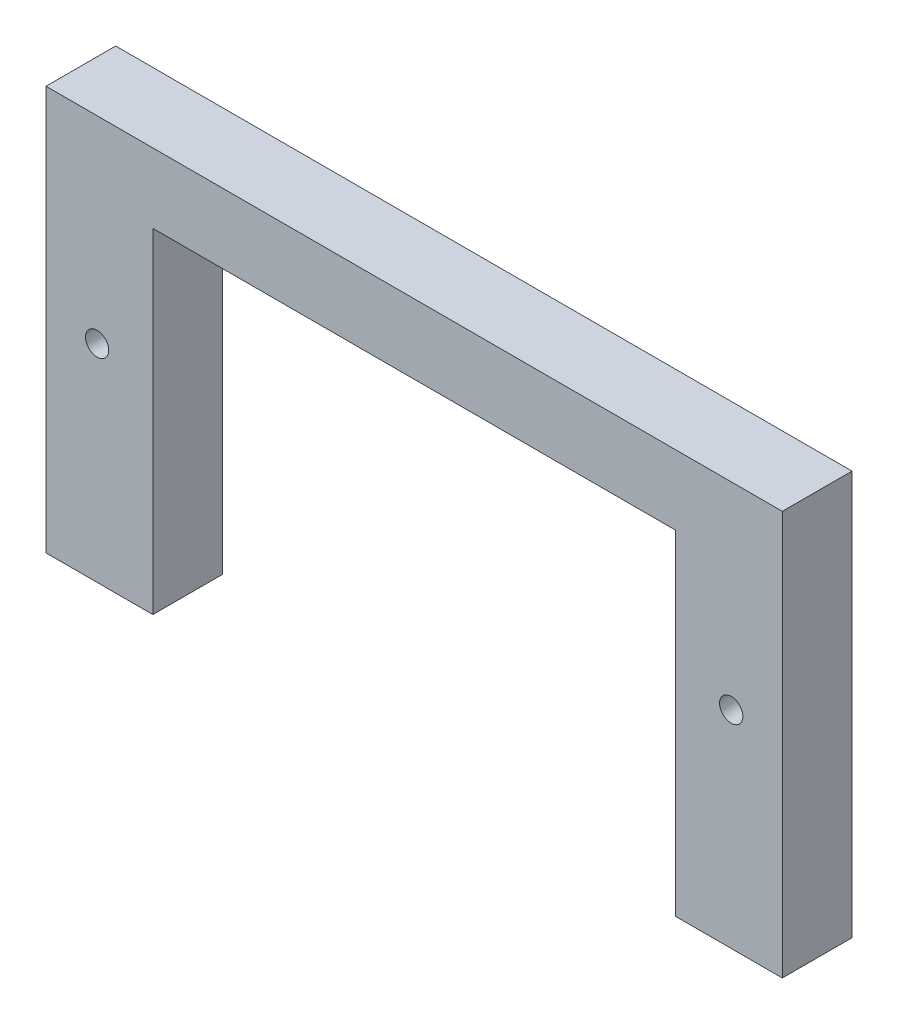
ISO-10303-21;
HEADER;
FILE_DESCRIPTION(('STEP AP214'),'2;1');
FILE_NAME('part.step','',(''),(''),'','','');
FILE_SCHEMA(('AUTOMOTIVE_DESIGN { 1 0 10303 214 1 1 1 1 }'));
ENDSEC;
DATA;
#1=APPLICATION_CONTEXT('core data for automotive mechanical design processes');
#2=APPLICATION_PROTOCOL_DEFINITION('international standard','automotive_design',2000,#1);
#3=PRODUCT_CONTEXT('',#1,'mechanical');
#4=PRODUCT('Part','Part','',(#3));
#5=PRODUCT_RELATED_PRODUCT_CATEGORY('part','',(#4));
#6=PRODUCT_DEFINITION_FORMATION('','',#4);
#7=PRODUCT_DEFINITION_CONTEXT('part definition',#1,'design');
#8=PRODUCT_DEFINITION('design','',#6,#7);
#9=PRODUCT_DEFINITION_SHAPE('','',#8);
#10=(LENGTH_UNIT() NAMED_UNIT(*) SI_UNIT(.MILLI.,.METRE.));
#11=(NAMED_UNIT(*) PLANE_ANGLE_UNIT() SI_UNIT($,.RADIAN.));
#12=(NAMED_UNIT(*) SI_UNIT($,.STERADIAN.) SOLID_ANGLE_UNIT());
#13=UNCERTAINTY_MEASURE_WITH_UNIT(LENGTH_MEASURE(1.E-05),#10,'distance_accuracy_value','');
#14=(GEOMETRIC_REPRESENTATION_CONTEXT(3) GLOBAL_UNCERTAINTY_ASSIGNED_CONTEXT((#13)) GLOBAL_UNIT_ASSIGNED_CONTEXT((#10,
#11,#12)) REPRESENTATION_CONTEXT('',''));
#15=CARTESIAN_POINT('',(0.,0.,0.));
#16=DIRECTION('',(0.,0.,1.));
#17=DIRECTION('',(1.,0.,0.));
#18=AXIS2_PLACEMENT_3D('',#15,#16,#17);
#19=CARTESIAN_POINT('',(0.,0.,3.));
#20=DIRECTION('',(0.,0.,1.));
#21=DIRECTION('',(1.,0.,0.));
#22=AXIS2_PLACEMENT_3D('',#19,#20,#21);
#23=PLANE('',#22);
#24=CARTESIAN_POINT('',(29.5,8.9,3.));
#25=DIRECTION('',(0.,0.,1.));
#26=DIRECTION('',(1.,0.,0.));
#27=AXIS2_PLACEMENT_3D('',#24,#25,#26);
#28=CIRCLE('',#27,0.499999999999999);
#29=CARTESIAN_POINT('',(30.,8.9,3.));
#30=VERTEX_POINT('',#29);
#31=EDGE_CURVE('E131',#30,#30,#28,.T.);
#32=ORIENTED_EDGE('',*,*,#31,.F.);
#33=EDGE_LOOP('',(#32));
#34=FACE_BOUND('',#33,.T.);
#35=DIRECTION('',(0.,-1.,0.));
#36=VECTOR('',#35,1.);
#37=CARTESIAN_POINT('',(0.,17.4,3.));
#38=LINE('',#37,#36);
#39=CARTESIAN_POINT('',(0.,17.4,3.));
#40=VERTEX_POINT('',#39);
#41=CARTESIAN_POINT('',(0.,0.,3.));
#42=VERTEX_POINT('',#41);
#43=EDGE_CURVE('E142',#40,#42,#38,.T.);
#44=ORIENTED_EDGE('',*,*,#43,.T.);
#45=DIRECTION('',(1.,0.,0.));
#46=VECTOR('',#45,1.);
#47=CARTESIAN_POINT('',(0.,0.,3.));
#48=LINE('',#47,#46);
#49=CARTESIAN_POINT('',(4.6,0.,3.));
#50=VERTEX_POINT('',#49);
#51=EDGE_CURVE('E90',#42,#50,#48,.T.);
#52=ORIENTED_EDGE('',*,*,#51,.T.);
#53=DIRECTION('',(0.,1.,0.));
#54=VECTOR('',#53,1.);
#55=CARTESIAN_POINT('',(4.6,0.,3.));
#56=LINE('',#55,#54);
#57=CARTESIAN_POINT('',(4.6,14.4,3.));
#58=VERTEX_POINT('',#57);
#59=EDGE_CURVE('E157',#50,#58,#56,.T.);
#60=ORIENTED_EDGE('',*,*,#59,.T.);
#61=DIRECTION('',(1.,0.,0.));
#62=VECTOR('',#61,1.);
#63=CARTESIAN_POINT('',(4.6,14.4,3.));
#64=LINE('',#63,#62);
#65=CARTESIAN_POINT('',(27.1,14.4,3.));
#66=VERTEX_POINT('',#65);
#67=EDGE_CURVE('E170',#58,#66,#64,.T.);
#68=ORIENTED_EDGE('',*,*,#67,.T.);
#69=DIRECTION('',(0.,-1.,0.));
#70=VECTOR('',#69,1.);
#71=CARTESIAN_POINT('',(27.1,14.4,3.));
#72=LINE('',#71,#70);
#73=CARTESIAN_POINT('',(27.1,0.,3.));
#74=VERTEX_POINT('',#73);
#75=EDGE_CURVE('E109',#66,#74,#72,.T.);
#76=ORIENTED_EDGE('',*,*,#75,.T.);
#77=DIRECTION('',(1.,0.,0.));
#78=VECTOR('',#77,1.);
#79=CARTESIAN_POINT('',(27.1,0.,3.));
#80=LINE('',#79,#78);
#81=CARTESIAN_POINT('',(31.7,0.,3.));
#82=VERTEX_POINT('',#81);
#83=EDGE_CURVE('E103',#74,#82,#80,.T.);
#84=ORIENTED_EDGE('',*,*,#83,.T.);
#85=DIRECTION('',(0.,1.,0.));
#86=VECTOR('',#85,1.);
#87=CARTESIAN_POINT('',(31.7,0.,3.));
#88=LINE('',#87,#86);
#89=CARTESIAN_POINT('',(31.7,17.4,3.));
#90=VERTEX_POINT('',#89);
#91=EDGE_CURVE('E107',#82,#90,#88,.T.);
#92=ORIENTED_EDGE('',*,*,#91,.T.);
#93=DIRECTION('',(-1.,0.,0.));
#94=VECTOR('',#93,1.);
#95=CARTESIAN_POINT('',(31.7,17.4,3.));
#96=LINE('',#95,#94);
#97=EDGE_CURVE('E47',#90,#40,#96,.T.);
#98=ORIENTED_EDGE('',*,*,#97,.T.);
#99=EDGE_LOOP('',(#44,#52,#60,#68,#76,#84,#92,#98));
#100=FACE_BOUND('',#99,.T.);
#101=CARTESIAN_POINT('',(2.20000000000004,8.9,3.));
#102=DIRECTION('',(0.,0.,1.));
#103=DIRECTION('',(1.,0.,0.));
#104=AXIS2_PLACEMENT_3D('',#101,#102,#103);
#105=CIRCLE('',#104,0.5);
#106=CARTESIAN_POINT('',(2.70000000000004,8.9,3.));
#107=VERTEX_POINT('',#106);
#108=EDGE_CURVE('E179',#107,#107,#105,.T.);
#109=ORIENTED_EDGE('',*,*,#108,.F.);
#110=EDGE_LOOP('',(#109));
#111=FACE_BOUND('',#110,.T.);
#112=ADVANCED_FACE('F30',(#34,#100,#111),#23,.T.);
#113=CARTESIAN_POINT('',(0.,0.,0.));
#114=DIRECTION('',(0.,0.,1.));
#115=DIRECTION('',(1.,0.,0.));
#116=AXIS2_PLACEMENT_3D('',#113,#114,#115);
#117=PLANE('',#116);
#118=DIRECTION('',(0.,-1.,0.));
#119=VECTOR('',#118,1.);
#120=CARTESIAN_POINT('',(0.,17.4,0.));
#121=LINE('',#120,#119);
#122=CARTESIAN_POINT('',(0.,17.4,0.));
#123=VERTEX_POINT('',#122);
#124=CARTESIAN_POINT('',(0.,0.,0.));
#125=VERTEX_POINT('',#124);
#126=EDGE_CURVE('E127',#123,#125,#121,.T.);
#127=ORIENTED_EDGE('',*,*,#126,.F.);
#128=DIRECTION('',(-1.,0.,0.));
#129=VECTOR('',#128,1.);
#130=CARTESIAN_POINT('',(31.7,17.4,0.));
#131=LINE('',#130,#129);
#132=CARTESIAN_POINT('',(31.7,17.4,0.));
#133=VERTEX_POINT('',#132);
#134=EDGE_CURVE('E82',#133,#123,#131,.T.);
#135=ORIENTED_EDGE('',*,*,#134,.F.);
#136=DIRECTION('',(0.,1.,0.));
#137=VECTOR('',#136,1.);
#138=CARTESIAN_POINT('',(31.7,0.,0.));
#139=LINE('',#138,#137);
#140=CARTESIAN_POINT('',(31.7,0.,0.));
#141=VERTEX_POINT('',#140);
#142=EDGE_CURVE('E76',#141,#133,#139,.T.);
#143=ORIENTED_EDGE('',*,*,#142,.F.);
#144=DIRECTION('',(1.,0.,0.));
#145=VECTOR('',#144,1.);
#146=CARTESIAN_POINT('',(27.1,0.,0.));
#147=LINE('',#146,#145);
#148=CARTESIAN_POINT('',(27.1,0.,0.));
#149=VERTEX_POINT('',#148);
#150=EDGE_CURVE('E117',#149,#141,#147,.T.);
#151=ORIENTED_EDGE('',*,*,#150,.F.);
#152=DIRECTION('',(0.,-1.,0.));
#153=VECTOR('',#152,1.);
#154=CARTESIAN_POINT('',(27.1,14.4,0.));
#155=LINE('',#154,#153);
#156=CARTESIAN_POINT('',(27.1,14.4,0.));
#157=VERTEX_POINT('',#156);
#158=EDGE_CURVE('E137',#157,#149,#155,.T.);
#159=ORIENTED_EDGE('',*,*,#158,.F.);
#160=DIRECTION('',(1.,0.,0.));
#161=VECTOR('',#160,1.);
#162=CARTESIAN_POINT('',(4.6,14.4,0.));
#163=LINE('',#162,#161);
#164=CARTESIAN_POINT('',(4.6,14.4,0.));
#165=VERTEX_POINT('',#164);
#166=EDGE_CURVE('E135',#165,#157,#163,.T.);
#167=ORIENTED_EDGE('',*,*,#166,.F.);
#168=DIRECTION('',(0.,1.,0.));
#169=VECTOR('',#168,1.);
#170=CARTESIAN_POINT('',(4.6,0.,0.));
#171=LINE('',#170,#169);
#172=CARTESIAN_POINT('',(4.6,0.,0.));
#173=VERTEX_POINT('',#172);
#174=EDGE_CURVE('E133',#173,#165,#171,.T.);
#175=ORIENTED_EDGE('',*,*,#174,.F.);
#176=DIRECTION('',(1.,0.,0.));
#177=VECTOR('',#176,1.);
#178=CARTESIAN_POINT('',(0.,0.,0.));
#179=LINE('',#178,#177);
#180=EDGE_CURVE('E130',#125,#173,#179,.T.);
#181=ORIENTED_EDGE('',*,*,#180,.F.);
#182=EDGE_LOOP('',(#127,#135,#143,#151,#159,#167,#175,#181));
#183=FACE_BOUND('',#182,.T.);
#184=CARTESIAN_POINT('',(29.5,8.9,0.));
#185=DIRECTION('',(0.,0.,1.));
#186=DIRECTION('',(1.,0.,0.));
#187=AXIS2_PLACEMENT_3D('',#184,#185,#186);
#188=CIRCLE('',#187,0.499999999999999);
#189=CARTESIAN_POINT('',(30.,8.9,0.));
#190=VERTEX_POINT('',#189);
#191=EDGE_CURVE('E176',#190,#190,#188,.T.);
#192=ORIENTED_EDGE('',*,*,#191,.T.);
#193=EDGE_LOOP('',(#192));
#194=FACE_BOUND('',#193,.T.);
#195=CARTESIAN_POINT('',(2.20000000000004,8.9,0.));
#196=DIRECTION('',(0.,0.,1.));
#197=DIRECTION('',(1.,0.,0.));
#198=AXIS2_PLACEMENT_3D('',#195,#196,#197);
#199=CIRCLE('',#198,0.5);
#200=CARTESIAN_POINT('',(2.70000000000004,8.9,0.));
#201=VERTEX_POINT('',#200);
#202=EDGE_CURVE('E182',#201,#201,#199,.T.);
#203=ORIENTED_EDGE('',*,*,#202,.T.);
#204=EDGE_LOOP('',(#203));
#205=FACE_BOUND('',#204,.T.);
#206=ADVANCED_FACE('F161',(#183,#194,#205),#117,.F.);
#207=CARTESIAN_POINT('',(0.,17.4,3.));
#208=DIRECTION('',(1.,0.,0.));
#209=DIRECTION('',(0.,1.,0.));
#210=AXIS2_PLACEMENT_3D('',#207,#208,#209);
#211=PLANE('',#210);
#212=ORIENTED_EDGE('',*,*,#126,.T.);
#213=DIRECTION('',(0.,0.,-1.));
#214=VECTOR('',#213,1.);
#215=CARTESIAN_POINT('',(0.,0.,3.));
#216=LINE('',#215,#214);
#217=EDGE_CURVE('E11',#42,#125,#216,.T.);
#218=ORIENTED_EDGE('',*,*,#217,.F.);
#219=ORIENTED_EDGE('',*,*,#43,.F.);
#220=DIRECTION('',(0.,0.,-1.));
#221=VECTOR('',#220,1.);
#222=CARTESIAN_POINT('',(0.,17.4,3.));
#223=LINE('',#222,#221);
#224=EDGE_CURVE('E123',#40,#123,#223,.T.);
#225=ORIENTED_EDGE('',*,*,#224,.T.);
#226=EDGE_LOOP('',(#212,#218,#219,#225));
#227=FACE_BOUND('',#226,.T.);
#228=ADVANCED_FACE('F32',(#227),#211,.F.);
#229=CARTESIAN_POINT('',(0.,0.,3.));
#230=DIRECTION('',(0.,1.,0.));
#231=DIRECTION('',(0.,0.,1.));
#232=AXIS2_PLACEMENT_3D('',#229,#230,#231);
#233=PLANE('',#232);
#234=ORIENTED_EDGE('',*,*,#180,.T.);
#235=DIRECTION('',(0.,0.,-1.));
#236=VECTOR('',#235,1.);
#237=CARTESIAN_POINT('',(4.6,0.,3.));
#238=LINE('',#237,#236);
#239=EDGE_CURVE('E39',#50,#173,#238,.T.);
#240=ORIENTED_EDGE('',*,*,#239,.F.);
#241=ORIENTED_EDGE('',*,*,#51,.F.);
#242=ORIENTED_EDGE('',*,*,#217,.T.);
#243=EDGE_LOOP('',(#234,#240,#241,#242));
#244=FACE_BOUND('',#243,.T.);
#245=ADVANCED_FACE('F214',(#244),#233,.F.);
#246=CARTESIAN_POINT('',(4.6,0.,3.));
#247=DIRECTION('',(-1.,0.,0.));
#248=DIRECTION('',(0.,0.,1.));
#249=AXIS2_PLACEMENT_3D('',#246,#247,#248);
#250=PLANE('',#249);
#251=ORIENTED_EDGE('',*,*,#174,.T.);
#252=DIRECTION('',(0.,0.,-1.));
#253=VECTOR('',#252,1.);
#254=CARTESIAN_POINT('',(4.6,14.4,3.));
#255=LINE('',#254,#253);
#256=EDGE_CURVE('E149',#58,#165,#255,.T.);
#257=ORIENTED_EDGE('',*,*,#256,.F.);
#258=ORIENTED_EDGE('',*,*,#59,.F.);
#259=ORIENTED_EDGE('',*,*,#239,.T.);
#260=EDGE_LOOP('',(#251,#257,#258,#259));
#261=FACE_BOUND('',#260,.T.);
#262=ADVANCED_FACE('F155',(#261),#250,.F.);
#263=CARTESIAN_POINT('',(4.6,14.4,3.));
#264=DIRECTION('',(0.,1.,0.));
#265=DIRECTION('',(0.,0.,1.));
#266=AXIS2_PLACEMENT_3D('',#263,#264,#265);
#267=PLANE('',#266);
#268=ORIENTED_EDGE('',*,*,#166,.T.);
#269=DIRECTION('',(0.,0.,-1.));
#270=VECTOR('',#269,1.);
#271=CARTESIAN_POINT('',(27.1,14.4,3.));
#272=LINE('',#271,#270);
#273=EDGE_CURVE('E146',#66,#157,#272,.T.);
#274=ORIENTED_EDGE('',*,*,#273,.F.);
#275=ORIENTED_EDGE('',*,*,#67,.F.);
#276=ORIENTED_EDGE('',*,*,#256,.T.);
#277=EDGE_LOOP('',(#268,#274,#275,#276));
#278=FACE_BOUND('',#277,.T.);
#279=ADVANCED_FACE('F166',(#278),#267,.F.);
#280=CARTESIAN_POINT('',(27.1,14.4,3.));
#281=DIRECTION('',(1.,0.,0.));
#282=DIRECTION('',(0.,0.,-1.));
#283=AXIS2_PLACEMENT_3D('',#280,#281,#282);
#284=PLANE('',#283);
#285=ORIENTED_EDGE('',*,*,#158,.T.);
#286=DIRECTION('',(0.,0.,-1.));
#287=VECTOR('',#286,1.);
#288=CARTESIAN_POINT('',(27.1,0.,3.));
#289=LINE('',#288,#287);
#290=EDGE_CURVE('E118',#74,#149,#289,.T.);
#291=ORIENTED_EDGE('',*,*,#290,.F.);
#292=ORIENTED_EDGE('',*,*,#75,.F.);
#293=ORIENTED_EDGE('',*,*,#273,.T.);
#294=EDGE_LOOP('',(#285,#291,#292,#293));
#295=FACE_BOUND('',#294,.T.);
#296=ADVANCED_FACE('F169',(#295),#284,.F.);
#297=CARTESIAN_POINT('',(27.1,0.,3.));
#298=DIRECTION('',(0.,1.,0.));
#299=DIRECTION('',(0.,0.,1.));
#300=AXIS2_PLACEMENT_3D('',#297,#298,#299);
#301=PLANE('',#300);
#302=ORIENTED_EDGE('',*,*,#150,.T.);
#303=DIRECTION('',(0.,0.,-1.));
#304=VECTOR('',#303,1.);
#305=CARTESIAN_POINT('',(31.7,0.,3.));
#306=LINE('',#305,#304);
#307=EDGE_CURVE('E114',#82,#141,#306,.T.);
#308=ORIENTED_EDGE('',*,*,#307,.F.);
#309=ORIENTED_EDGE('',*,*,#83,.F.);
#310=ORIENTED_EDGE('',*,*,#290,.T.);
#311=EDGE_LOOP('',(#302,#308,#309,#310));
#312=FACE_BOUND('',#311,.T.);
#313=ADVANCED_FACE('F115',(#312),#301,.F.);
#314=CARTESIAN_POINT('',(31.7,0.,3.));
#315=DIRECTION('',(-1.,0.,0.));
#316=DIRECTION('',(0.,0.,1.));
#317=AXIS2_PLACEMENT_3D('',#314,#315,#316);
#318=PLANE('',#317);
#319=ORIENTED_EDGE('',*,*,#142,.T.);
#320=DIRECTION('',(0.,0.,-1.));
#321=VECTOR('',#320,1.);
#322=CARTESIAN_POINT('',(31.7,17.4,3.));
#323=LINE('',#322,#321);
#324=EDGE_CURVE('E119',#90,#133,#323,.T.);
#325=ORIENTED_EDGE('',*,*,#324,.F.);
#326=ORIENTED_EDGE('',*,*,#91,.F.);
#327=ORIENTED_EDGE('',*,*,#307,.T.);
#328=EDGE_LOOP('',(#319,#325,#326,#327));
#329=FACE_BOUND('',#328,.T.);
#330=ADVANCED_FACE('F121',(#329),#318,.F.);
#331=CARTESIAN_POINT('',(31.7,17.4,3.));
#332=DIRECTION('',(0.,-1.,0.));
#333=DIRECTION('',(1.,0.,0.));
#334=AXIS2_PLACEMENT_3D('',#331,#332,#333);
#335=PLANE('',#334);
#336=ORIENTED_EDGE('',*,*,#134,.T.);
#337=ORIENTED_EDGE('',*,*,#224,.F.);
#338=ORIENTED_EDGE('',*,*,#97,.F.);
#339=ORIENTED_EDGE('',*,*,#324,.T.);
#340=EDGE_LOOP('',(#336,#337,#338,#339));
#341=FACE_BOUND('',#340,.T.);
#342=ADVANCED_FACE('F202',(#341),#335,.F.);
#343=CARTESIAN_POINT('',(29.5,8.9,3.));
#344=DIRECTION('',(0.,0.,-1.));
#345=DIRECTION('',(-1.,0.,0.));
#346=AXIS2_PLACEMENT_3D('',#343,#344,#345);
#347=CYLINDRICAL_SURFACE('',#346,0.499999999999999);
#348=ORIENTED_EDGE('',*,*,#31,.T.);
#349=EDGE_LOOP('',(#348));
#350=FACE_BOUND('',#349,.T.);
#351=ORIENTED_EDGE('',*,*,#191,.F.);
#352=EDGE_LOOP('',(#351));
#353=FACE_BOUND('',#352,.T.);
#354=ADVANCED_FACE('F199',(#350,#353),#347,.F.);
#355=CARTESIAN_POINT('',(2.20000000000004,8.9,3.));
#356=DIRECTION('',(0.,0.,-1.));
#357=DIRECTION('',(-1.,0.,0.));
#358=AXIS2_PLACEMENT_3D('',#355,#356,#357);
#359=CYLINDRICAL_SURFACE('',#358,0.5);
#360=ORIENTED_EDGE('',*,*,#108,.T.);
#361=EDGE_LOOP('',(#360));
#362=FACE_BOUND('',#361,.T.);
#363=ORIENTED_EDGE('',*,*,#202,.F.);
#364=EDGE_LOOP('',(#363));
#365=FACE_BOUND('',#364,.T.);
#366=ADVANCED_FACE('F188',(#362,#365),#359,.F.);
#367=CLOSED_SHELL('',(#112,#206,#228,#245,#262,#279,#296,#313,#330,#342,#354,#366));
#368=MANIFOLD_SOLID_BREP('B2',#367);
#369=ADVANCED_BREP_SHAPE_REPRESENTATION('',(#18,#368),#14);
#370=SHAPE_DEFINITION_REPRESENTATION(#9,#369);
ENDSEC;
END-ISO-10303-21;
